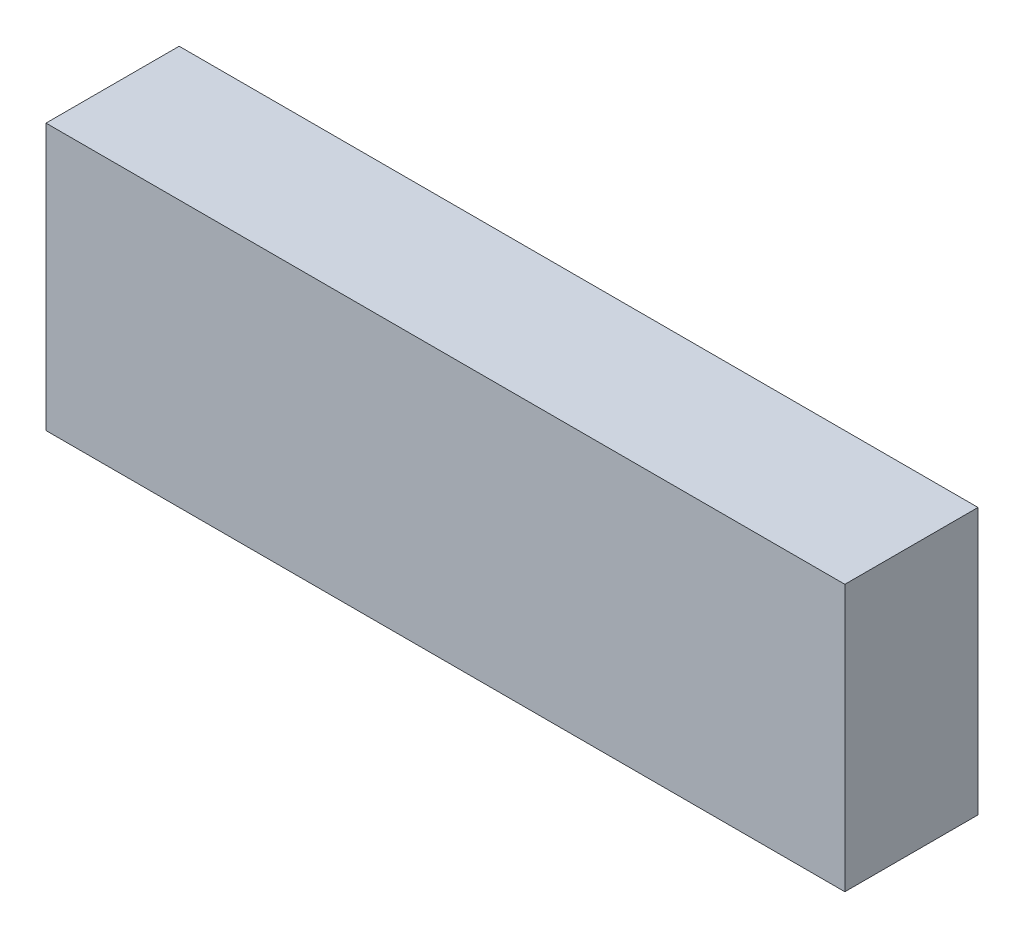
ISO-10303-21;
HEADER;
FILE_DESCRIPTION(('STEP AP214'),'2;1');
FILE_NAME('part.step','',(''),(''),'','','');
FILE_SCHEMA(('AUTOMOTIVE_DESIGN { 1 0 10303 214 1 1 1 1 }'));
ENDSEC;
DATA;
#1=APPLICATION_CONTEXT('core data for automotive mechanical design processes');
#2=APPLICATION_PROTOCOL_DEFINITION('international standard','automotive_design',2000,#1);
#3=PRODUCT_CONTEXT('',#1,'mechanical');
#4=PRODUCT('Part','Part','',(#3));
#5=PRODUCT_RELATED_PRODUCT_CATEGORY('part','',(#4));
#6=PRODUCT_DEFINITION_FORMATION('','',#4);
#7=PRODUCT_DEFINITION_CONTEXT('part definition',#1,'design');
#8=PRODUCT_DEFINITION('design','',#6,#7);
#9=PRODUCT_DEFINITION_SHAPE('','',#8);
#10=(LENGTH_UNIT() NAMED_UNIT(*) SI_UNIT(.MILLI.,.METRE.));
#11=(NAMED_UNIT(*) PLANE_ANGLE_UNIT() SI_UNIT($,.RADIAN.));
#12=(NAMED_UNIT(*) SI_UNIT($,.STERADIAN.) SOLID_ANGLE_UNIT());
#13=UNCERTAINTY_MEASURE_WITH_UNIT(LENGTH_MEASURE(1.E-05),#10,'distance_accuracy_value','');
#14=(GEOMETRIC_REPRESENTATION_CONTEXT(3) GLOBAL_UNCERTAINTY_ASSIGNED_CONTEXT((#13)) GLOBAL_UNIT_ASSIGNED_CONTEXT((#10,
#11,#12)) REPRESENTATION_CONTEXT('',''));
#15=CARTESIAN_POINT('',(0.,0.,0.));
#16=DIRECTION('',(0.,0.,1.));
#17=DIRECTION('',(1.,0.,0.));
#18=AXIS2_PLACEMENT_3D('',#15,#16,#17);
#19=CARTESIAN_POINT('',(1.375,1.675,0.));
#20=DIRECTION('',(1.,0.,0.));
#21=DIRECTION('',(0.,0.,1.));
#22=AXIS2_PLACEMENT_3D('',#19,#20,#21);
#23=PLANE('',#22);
#24=DIRECTION('',(0.,1.,0.));
#25=VECTOR('',#24,1.);
#26=CARTESIAN_POINT('',(1.375,1.675,0.1));
#27=LINE('',#26,#25);
#28=CARTESIAN_POINT('',(1.375,1.675,0.1));
#29=VERTEX_POINT('',#28);
#30=CARTESIAN_POINT('',(1.375,1.875,0.1));
#31=VERTEX_POINT('',#30);
#32=EDGE_CURVE('E11',#29,#31,#27,.T.);
#33=ORIENTED_EDGE('',*,*,#32,.T.);
#34=DIRECTION('',(0.,0.,1.));
#35=VECTOR('',#34,1.);
#36=CARTESIAN_POINT('',(1.375,1.875,0.));
#37=LINE('',#36,#35);
#38=CARTESIAN_POINT('',(1.375,1.875,0.));
#39=VERTEX_POINT('',#38);
#40=EDGE_CURVE('E24',#39,#31,#37,.T.);
#41=ORIENTED_EDGE('',*,*,#40,.F.);
#42=DIRECTION('',(0.,1.,0.));
#43=VECTOR('',#42,1.);
#44=CARTESIAN_POINT('',(1.375,1.675,0.));
#45=LINE('',#44,#43);
#46=CARTESIAN_POINT('',(1.375,1.675,0.));
#47=VERTEX_POINT('',#46);
#48=EDGE_CURVE('E86',#47,#39,#45,.T.);
#49=ORIENTED_EDGE('',*,*,#48,.F.);
#50=DIRECTION('',(0.,0.,1.));
#51=VECTOR('',#50,1.);
#52=CARTESIAN_POINT('',(1.375,1.675,0.));
#53=LINE('',#52,#51);
#54=EDGE_CURVE('E36',#47,#29,#53,.T.);
#55=ORIENTED_EDGE('',*,*,#54,.T.);
#56=EDGE_LOOP('',(#33,#41,#49,#55));
#57=FACE_BOUND('',#56,.T.);
#58=ADVANCED_FACE('F17',(#57),#23,.F.);
#59=CARTESIAN_POINT('',(1.975,1.675,0.));
#60=DIRECTION('',(1.,0.,0.));
#61=DIRECTION('',(0.,0.,1.));
#62=AXIS2_PLACEMENT_3D('',#59,#60,#61);
#63=PLANE('',#62);
#64=DIRECTION('',(0.,0.,1.));
#65=VECTOR('',#64,1.);
#66=CARTESIAN_POINT('',(1.975,1.675,0.));
#67=LINE('',#66,#65);
#68=CARTESIAN_POINT('',(1.975,1.675,0.));
#69=VERTEX_POINT('',#68);
#70=CARTESIAN_POINT('',(1.975,1.675,0.1));
#71=VERTEX_POINT('',#70);
#72=EDGE_CURVE('E83',#69,#71,#67,.T.);
#73=ORIENTED_EDGE('',*,*,#72,.F.);
#74=DIRECTION('',(0.,1.,0.));
#75=VECTOR('',#74,1.);
#76=CARTESIAN_POINT('',(1.975,1.675,0.));
#77=LINE('',#76,#75);
#78=CARTESIAN_POINT('',(1.975,1.875,0.));
#79=VERTEX_POINT('',#78);
#80=EDGE_CURVE('E63',#69,#79,#77,.T.);
#81=ORIENTED_EDGE('',*,*,#80,.T.);
#82=DIRECTION('',(0.,0.,1.));
#83=VECTOR('',#82,1.);
#84=CARTESIAN_POINT('',(1.975,1.875,0.));
#85=LINE('',#84,#83);
#86=CARTESIAN_POINT('',(1.975,1.875,0.1));
#87=VERTEX_POINT('',#86);
#88=EDGE_CURVE('E57',#79,#87,#85,.T.);
#89=ORIENTED_EDGE('',*,*,#88,.T.);
#90=DIRECTION('',(0.,1.,0.));
#91=VECTOR('',#90,1.);
#92=CARTESIAN_POINT('',(1.975,1.675,0.1));
#93=LINE('',#92,#91);
#94=EDGE_CURVE('E60',#71,#87,#93,.T.);
#95=ORIENTED_EDGE('',*,*,#94,.F.);
#96=EDGE_LOOP('',(#73,#81,#89,#95));
#97=FACE_BOUND('',#96,.T.);
#98=ADVANCED_FACE('F59',(#97),#63,.T.);
#99=CARTESIAN_POINT('',(1.375,1.675,0.));
#100=DIRECTION('',(0.,1.,0.));
#101=DIRECTION('',(0.,0.,1.));
#102=AXIS2_PLACEMENT_3D('',#99,#100,#101);
#103=PLANE('',#102);
#104=ORIENTED_EDGE('',*,*,#72,.T.);
#105=DIRECTION('',(1.,0.,0.));
#106=VECTOR('',#105,1.);
#107=CARTESIAN_POINT('',(1.375,1.675,0.1));
#108=LINE('',#107,#106);
#109=EDGE_CURVE('E71',#29,#71,#108,.T.);
#110=ORIENTED_EDGE('',*,*,#109,.F.);
#111=ORIENTED_EDGE('',*,*,#54,.F.);
#112=DIRECTION('',(1.,0.,0.));
#113=VECTOR('',#112,1.);
#114=CARTESIAN_POINT('',(1.375,1.675,0.));
#115=LINE('',#114,#113);
#116=EDGE_CURVE('E76',#47,#69,#115,.T.);
#117=ORIENTED_EDGE('',*,*,#116,.T.);
#118=EDGE_LOOP('',(#104,#110,#111,#117));
#119=FACE_BOUND('',#118,.T.);
#120=ADVANCED_FACE('F91',(#119),#103,.F.);
#121=CARTESIAN_POINT('',(1.375,1.875,0.));
#122=DIRECTION('',(0.,1.,0.));
#123=DIRECTION('',(0.,0.,1.));
#124=AXIS2_PLACEMENT_3D('',#121,#122,#123);
#125=PLANE('',#124);
#126=DIRECTION('',(1.,0.,0.));
#127=VECTOR('',#126,1.);
#128=CARTESIAN_POINT('',(1.375,1.875,0.));
#129=LINE('',#128,#127);
#130=EDGE_CURVE('E74',#39,#79,#129,.T.);
#131=ORIENTED_EDGE('',*,*,#130,.F.);
#132=ORIENTED_EDGE('',*,*,#40,.T.);
#133=DIRECTION('',(1.,0.,0.));
#134=VECTOR('',#133,1.);
#135=CARTESIAN_POINT('',(1.375,1.875,0.1));
#136=LINE('',#135,#134);
#137=EDGE_CURVE('E69',#31,#87,#136,.T.);
#138=ORIENTED_EDGE('',*,*,#137,.T.);
#139=ORIENTED_EDGE('',*,*,#88,.F.);
#140=EDGE_LOOP('',(#131,#132,#138,#139));
#141=FACE_BOUND('',#140,.T.);
#142=ADVANCED_FACE('F73',(#141),#125,.T.);
#143=CARTESIAN_POINT('',(1.375,1.675,0.));
#144=DIRECTION('',(0.,0.,1.));
#145=DIRECTION('',(1.,0.,0.));
#146=AXIS2_PLACEMENT_3D('',#143,#144,#145);
#147=PLANE('',#146);
#148=ORIENTED_EDGE('',*,*,#130,.T.);
#149=ORIENTED_EDGE('',*,*,#80,.F.);
#150=ORIENTED_EDGE('',*,*,#116,.F.);
#151=ORIENTED_EDGE('',*,*,#48,.T.);
#152=EDGE_LOOP('',(#148,#149,#150,#151));
#153=FACE_BOUND('',#152,.T.);
#154=ADVANCED_FACE('F89',(#153),#147,.F.);
#155=CARTESIAN_POINT('',(1.375,1.675,0.1));
#156=DIRECTION('',(0.,0.,1.));
#157=DIRECTION('',(1.,0.,0.));
#158=AXIS2_PLACEMENT_3D('',#155,#156,#157);
#159=PLANE('',#158);
#160=ORIENTED_EDGE('',*,*,#32,.F.);
#161=ORIENTED_EDGE('',*,*,#109,.T.);
#162=ORIENTED_EDGE('',*,*,#94,.T.);
#163=ORIENTED_EDGE('',*,*,#137,.F.);
#164=EDGE_LOOP('',(#160,#161,#162,#163));
#165=FACE_BOUND('',#164,.T.);
#166=ADVANCED_FACE('F68',(#165),#159,.T.);
#167=CLOSED_SHELL('',(#58,#98,#120,#142,#154,#166));
#168=MANIFOLD_SOLID_BREP('B1',#167);
#169=ADVANCED_BREP_SHAPE_REPRESENTATION('',(#18,#168),#14);
#170=SHAPE_DEFINITION_REPRESENTATION(#9,#169);
ENDSEC;
END-ISO-10303-21;
